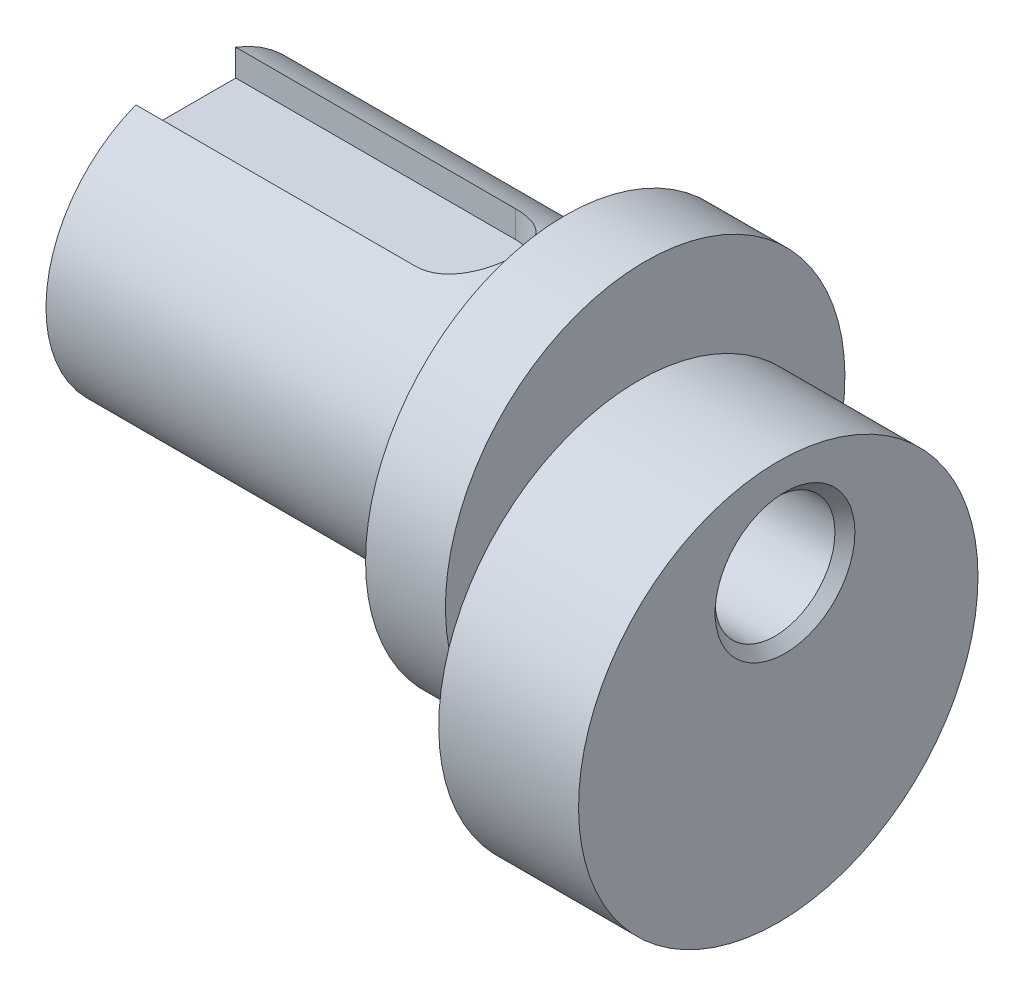
ISO-10303-21;
HEADER;
FILE_DESCRIPTION(('STEP AP214'),'2;1');
FILE_NAME('part.step','',(''),(''),'','','');
FILE_SCHEMA(('AUTOMOTIVE_DESIGN { 1 0 10303 214 1 1 1 1 }'));
ENDSEC;
DATA;
#1=APPLICATION_CONTEXT('core data for automotive mechanical design processes');
#2=APPLICATION_PROTOCOL_DEFINITION('international standard','automotive_design',2000,#1);
#3=PRODUCT_CONTEXT('',#1,'mechanical');
#4=PRODUCT('Part','Part','',(#3));
#5=PRODUCT_RELATED_PRODUCT_CATEGORY('part','',(#4));
#6=PRODUCT_DEFINITION_FORMATION('','',#4);
#7=PRODUCT_DEFINITION_CONTEXT('part definition',#1,'design');
#8=PRODUCT_DEFINITION('design','',#6,#7);
#9=PRODUCT_DEFINITION_SHAPE('','',#8);
#10=(LENGTH_UNIT() NAMED_UNIT(*) SI_UNIT(.MILLI.,.METRE.));
#11=(NAMED_UNIT(*) PLANE_ANGLE_UNIT() SI_UNIT($,.RADIAN.));
#12=(NAMED_UNIT(*) SI_UNIT($,.STERADIAN.) SOLID_ANGLE_UNIT());
#13=UNCERTAINTY_MEASURE_WITH_UNIT(LENGTH_MEASURE(1.E-05),#10,'distance_accuracy_value','');
#14=(GEOMETRIC_REPRESENTATION_CONTEXT(3) GLOBAL_UNCERTAINTY_ASSIGNED_CONTEXT((#13)) GLOBAL_UNIT_ASSIGNED_CONTEXT((#10,
#11,#12)) REPRESENTATION_CONTEXT('',''));
#15=CARTESIAN_POINT('',(0.,0.,0.));
#16=DIRECTION('',(0.,0.,1.));
#17=DIRECTION('',(1.,0.,0.));
#18=AXIS2_PLACEMENT_3D('',#15,#16,#17);
#19=CARTESIAN_POINT('',(-23.,5.,-0.336496213383556));
#20=DIRECTION('',(1.,0.,0.));
#21=DIRECTION('',(0.,0.,-1.));
#22=AXIS2_PLACEMENT_3D('',#19,#20,#21);
#23=CYLINDRICAL_SURFACE('',#22,7.);
#24=CARTESIAN_POINT('',(-4.,5.,-0.336496213383556));
#25=DIRECTION('',(-1.,0.,0.));
#26=DIRECTION('',(0.,0.,1.));
#27=AXIS2_PLACEMENT_3D('',#24,#25,#26);
#28=CIRCLE('',#27,7.);
#29=CARTESIAN_POINT('',(-4.,5.,6.66350378661644));
#30=VERTEX_POINT('',#29);
#31=EDGE_CURVE('E138',#30,#30,#28,.T.);
#32=ORIENTED_EDGE('',*,*,#31,.T.);
#33=EDGE_LOOP('',(#32));
#34=FACE_BOUND('',#33,.T.);
#35=DIRECTION('',(1.,0.,0.));
#36=VECTOR('',#35,1.);
#37=CARTESIAN_POINT('',(-23.,11.538348415311,-2.83649621338356));
#38=LINE('',#37,#36);
#39=CARTESIAN_POINT('',(-9.,11.538348415311,-2.83649621338356));
#40=VERTEX_POINT('',#39);
#41=CARTESIAN_POINT('',(-23.,11.538348415311,-2.83649621338356));
#42=VERTEX_POINT('',#41);
#43=EDGE_CURVE('E130',#40,#42,#38,.F.);
#44=ORIENTED_EDGE('',*,*,#43,.F.);
#45=CARTESIAN_POINT('',(-9.,11.538348415311,2.16350378661644));
#46=CARTESIAN_POINT('',(-8.93211075427106,11.5383365378513,2.16351310882548));
#47=CARTESIAN_POINT('',(-8.86422806736091,11.5394054992274,2.16073863738338));
#48=CARTESIAN_POINT('',(-8.72899608938858,11.5436165747813,2.14969480779804));
#49=CARTESIAN_POINT('',(-8.66164664139387,11.5467580541806,2.14142713212853));
#50=CARTESIAN_POINT('',(-8.52817858539721,11.5550121763794,2.11950553947544));
#51=CARTESIAN_POINT('',(-8.46205666366019,11.5601183170568,2.10586938625599));
#52=CARTESIAN_POINT('',(-8.33129816489152,11.5721317785417,2.07335494128293));
#53=CARTESIAN_POINT('',(-8.26666165368758,11.5790391790075,2.0544764176908));
#54=CARTESIAN_POINT('',(-8.07573563352248,11.6021493436571,1.99024342840849));
#55=CARTESIAN_POINT('',(-7.95220954786442,11.6207547534084,1.9372549126863));
#56=CARTESIAN_POINT('',(-7.71576966687202,11.6622539736071,1.81261136527069));
#57=CARTESIAN_POINT('',(-7.60286368326447,11.6851509042488,1.74094273710493));
#58=CARTESIAN_POINT('',(-7.38578478664729,11.7337991379222,1.57752949763614));
#59=CARTESIAN_POINT('',(-7.28215352480412,11.7596286404137,1.48508715808388));
#60=CARTESIAN_POINT('',(-7.09149129528357,11.8105759232303,1.28423767437974));
#61=CARTESIAN_POINT('',(-7.00446342075665,11.8356935701987,1.17582756214318));
#62=CARTESIAN_POINT('',(-6.84691014454501,11.8833113327905,0.942042939975786));
#63=CARTESIAN_POINT('',(-6.77696847813946,11.905708352238,0.816252124508294));
#64=CARTESIAN_POINT('',(-6.65946335320259,11.9444235767263,0.553754612093079));
#65=CARTESIAN_POINT('',(-6.61189222095399,11.9607438658547,0.41705167715677));
#66=CARTESIAN_POINT('',(-6.54235939781764,11.9849105051071,0.142333765872618));
#67=CARTESIAN_POINT('',(-6.51946086952892,11.9930659435251,0.00458362184390952));
#68=CARTESIAN_POINT('',(-6.49693159722235,12.0010879805382,-0.273031908086653));
#69=CARTESIAN_POINT('',(-6.49729441396535,12.000956873027,-0.412896697891005));
#70=CARTESIAN_POINT('',(-6.52071127376112,11.9926225804908,-0.684089471870503));
#71=CARTESIAN_POINT('',(-6.54274479419853,11.9847824358352,-0.815518620462278));
#72=CARTESIAN_POINT('',(-6.6071734241588,11.9623783250735,-1.07267202552716));
#73=CARTESIAN_POINT('',(-6.64956968436252,11.9478139789904,-1.19839595916402));
#74=CARTESIAN_POINT('',(-6.75404691156532,11.9131650689037,-1.44265723768163));
#75=CARTESIAN_POINT('',(-6.81639571496012,11.8930059216431,-1.56106900405262));
#76=CARTESIAN_POINT('',(-6.95877933522336,11.8492335561632,-1.78603152643879));
#77=CARTESIAN_POINT('',(-7.03881952378359,11.8256192895926,-1.89257866515126));
#78=CARTESIAN_POINT('',(-7.2193232636567,11.7759054780549,-2.09682066594426));
#79=CARTESIAN_POINT('',(-7.3206497231449,11.7497405584388,-2.19373807038773));
#80=CARTESIAN_POINT('',(-7.53832736416557,11.6989034246898,-2.36949535959652));
#81=CARTESIAN_POINT('',(-7.65468390516847,11.6742317476526,-2.44832876794818));
#82=CARTESIAN_POINT('',(-7.90194259852198,11.628778038754,-2.58699482236814));
#83=CARTESIAN_POINT('',(-8.03307897550541,11.6080787511899,-2.64643829327981));
#84=CARTESIAN_POINT('',(-8.30436480158219,11.5738821361027,-2.74205061064205));
#85=CARTESIAN_POINT('',(-8.44449914116898,11.5603730716505,-2.7782574073831));
#86=CARTESIAN_POINT('',(-8.65503054426421,11.5470854224556,-2.81355118486983));
#87=CARTESIAN_POINT('',(-8.72373630177179,11.5438201096791,-2.82214968924801));
#88=CARTESIAN_POINT('',(-8.86161516419169,11.5394491082968,-2.83361973513238));
#89=CARTESIAN_POINT('',(-8.93078766710051,11.5383410314094,-2.83649761003723));
#90=CARTESIAN_POINT('',(-9.,11.538348415311,-2.83649621338356));
#91=B_SPLINE_CURVE_WITH_KNOTS('',3,(#45,#46,#47,#48,#49,#50,#51,#52,#53,#54,#55,#56,#57,#58,#59,
#60,#61,#62,#63,#64,#65,#66,#67,#68,#69,#70,#71,#72,#73,#74,#75,#76,#77,#78,#79,#80,#81,#82,#83,
#84,#85,#86,#87,#88,#89,#90),.UNSPECIFIED.,.F.,.F.,(4,2,2,2,2,2,2,2,2,2,2,2,2,2,2,2,2,2,2,2,2,2,
4),(0.,0.20359162855159,0.407120929225528,0.609982356545743,0.812852756635989,1.21793118555512,
1.6233052814847,2.0451597231193,2.4670926781184,2.90188398965561,3.33652604665238,
3.75400993940862,4.17137826416922,4.56998920861347,4.96862268086888,5.37284909448639,
5.77719841367921,6.20315837945088,6.62927065674721,7.06347329058505,7.49696496492444,
7.70468580162773,7.91217653896403),.UNSPECIFIED.);
#92=CARTESIAN_POINT('',(-9.,11.538348415311,2.16350378661644));
#93=VERTEX_POINT('',#92);
#94=EDGE_CURVE('E11',#93,#40,#91,.T.);
#95=ORIENTED_EDGE('',*,*,#94,.F.);
#96=DIRECTION('',(1.,0.,0.));
#97=VECTOR('',#96,1.);
#98=CARTESIAN_POINT('',(-23.,11.538348415311,2.16350378661645));
#99=LINE('',#98,#97);
#100=CARTESIAN_POINT('',(-23.,11.538348415311,2.16350378661645));
#101=VERTEX_POINT('',#100);
#102=EDGE_CURVE('E109',#101,#93,#99,.T.);
#103=ORIENTED_EDGE('',*,*,#102,.F.);
#104=CARTESIAN_POINT('',(-23.,5.,-0.336496213383556));
#105=DIRECTION('',(-1.,0.,0.));
#106=DIRECTION('',(0.,0.,1.));
#107=AXIS2_PLACEMENT_3D('',#104,#105,#106);
#108=CIRCLE('',#107,7.);
#109=EDGE_CURVE('E133',#42,#101,#108,.T.);
#110=ORIENTED_EDGE('',*,*,#109,.F.);
#111=EDGE_LOOP('',(#44,#95,#103,#110));
#112=FACE_BOUND('',#111,.T.);
#113=ADVANCED_FACE('F45',(#34,#112),#23,.T.);
#114=CARTESIAN_POINT('',(-23.,5.,-0.336496213383556));
#115=DIRECTION('',(-1.,0.,0.));
#116=DIRECTION('',(0.,0.,1.));
#117=AXIS2_PLACEMENT_3D('',#114,#115,#116);
#118=PLANE('',#117);
#119=CARTESIAN_POINT('',(-23.,5.,-0.336496213383556));
#120=DIRECTION('',(-1.,0.,0.));
#121=DIRECTION('',(0.,0.,1.));
#122=AXIS2_PLACEMENT_3D('',#119,#120,#121);
#123=CIRCLE('',#122,3.5);
#124=CARTESIAN_POINT('',(-23.,5.,3.16350378661644));
#125=VERTEX_POINT('',#124);
#126=EDGE_CURVE('E168',#125,#125,#123,.F.);
#127=ORIENTED_EDGE('',*,*,#126,.T.);
#128=EDGE_LOOP('',(#127));
#129=FACE_BOUND('',#128,.T.);
#130=DIRECTION('',(0.,0.,1.));
#131=VECTOR('',#130,1.);
#132=CARTESIAN_POINT('',(-23.,10.2,-0.336496213383556));
#133=LINE('',#132,#131);
#134=CARTESIAN_POINT('',(-23.,10.2,-2.83649621338356));
#135=VERTEX_POINT('',#134);
#136=CARTESIAN_POINT('',(-23.,10.2,2.16350378661645));
#137=VERTEX_POINT('',#136);
#138=EDGE_CURVE('E172',#135,#137,#133,.T.);
#139=ORIENTED_EDGE('',*,*,#138,.F.);
#140=DIRECTION('',(0.,1.,0.));
#141=VECTOR('',#140,1.);
#142=CARTESIAN_POINT('',(-23.,5.,-2.83649621338356));
#143=LINE('',#142,#141);
#144=EDGE_CURVE('E61',#135,#42,#143,.T.);
#145=ORIENTED_EDGE('',*,*,#144,.T.);
#146=ORIENTED_EDGE('',*,*,#109,.T.);
#147=DIRECTION('',(0.,-1.,0.));
#148=VECTOR('',#147,1.);
#149=CARTESIAN_POINT('',(-23.,5.,2.16350378661645));
#150=LINE('',#149,#148);
#151=EDGE_CURVE('E175',#101,#137,#150,.T.);
#152=ORIENTED_EDGE('',*,*,#151,.T.);
#153=EDGE_LOOP('',(#139,#145,#146,#152));
#154=FACE_BOUND('',#153,.T.);
#155=ADVANCED_FACE('F181',(#129,#154),#118,.T.);
#156=CARTESIAN_POINT('',(7.,0.,0.));
#157=DIRECTION('',(-1.,0.,0.));
#158=DIRECTION('',(0.,0.,1.));
#159=AXIS2_PLACEMENT_3D('',#156,#157,#158);
#160=CYLINDRICAL_SURFACE('',#159,9.99999999999999);
#161=CARTESIAN_POINT('',(7.,0.,0.));
#162=DIRECTION('',(1.,0.,0.));
#163=DIRECTION('',(0.,0.,-1.));
#164=AXIS2_PLACEMENT_3D('',#161,#162,#163);
#165=CIRCLE('',#164,9.99999999999999);
#166=CARTESIAN_POINT('',(7.,0.,-9.99999999999999));
#167=VERTEX_POINT('',#166);
#168=EDGE_CURVE('E143',#167,#167,#165,.T.);
#169=ORIENTED_EDGE('',*,*,#168,.F.);
#170=EDGE_LOOP('',(#169));
#171=FACE_BOUND('',#170,.T.);
#172=CARTESIAN_POINT('',(0.,0.,0.));
#173=DIRECTION('',(1.,0.,0.));
#174=DIRECTION('',(0.,0.,-1.));
#175=AXIS2_PLACEMENT_3D('',#172,#173,#174);
#176=CIRCLE('',#175,9.99999999999999);
#177=CARTESIAN_POINT('',(0.,1.84994671317873,-9.8273952377219));
#178=VERTEX_POINT('',#177);
#179=CARTESIAN_POINT('',(0.,3.15005328682125,9.49089902433835));
#180=VERTEX_POINT('',#179);
#181=EDGE_CURVE('E154',#178,#180,#176,.T.);
#182=ORIENTED_EDGE('',*,*,#181,.T.);
#183=EDGE_CURVE('E148',#180,#178,#176,.T.);
#184=ORIENTED_EDGE('',*,*,#183,.T.);
#185=EDGE_LOOP('',(#182,#184));
#186=FACE_BOUND('',#185,.T.);
#187=ADVANCED_FACE('F199',(#171,#186),#160,.T.);
#188=CARTESIAN_POINT('',(7.,0.,0.));
#189=DIRECTION('',(1.,0.,0.));
#190=DIRECTION('',(0.,0.,-1.));
#191=AXIS2_PLACEMENT_3D('',#188,#189,#190);
#192=PLANE('',#191);
#193=CARTESIAN_POINT('',(7.,5.,-0.336496213383556));
#194=DIRECTION('',(1.,0.,0.));
#195=DIRECTION('',(0.,0.,-1.));
#196=AXIS2_PLACEMENT_3D('',#193,#194,#195);
#197=CIRCLE('',#196,3.5);
#198=CARTESIAN_POINT('',(7.,5.,-3.83649621338356));
#199=VERTEX_POINT('',#198);
#200=EDGE_CURVE('E142',#199,#199,#197,.F.);
#201=ORIENTED_EDGE('',*,*,#200,.T.);
#202=EDGE_LOOP('',(#201));
#203=FACE_BOUND('',#202,.T.);
#204=ORIENTED_EDGE('',*,*,#168,.T.);
#205=EDGE_LOOP('',(#204));
#206=FACE_BOUND('',#205,.T.);
#207=ADVANCED_FACE('F219',(#203,#206),#192,.T.);
#208=CARTESIAN_POINT('',(0.,0.,0.));
#209=DIRECTION('',(1.,0.,0.));
#210=DIRECTION('',(0.,0.,-1.));
#211=AXIS2_PLACEMENT_3D('',#208,#209,#210);
#212=PLANE('',#211);
#213=CARTESIAN_POINT('',(0.,5.,-0.336496213383556));
#214=DIRECTION('',(-1.,0.,0.));
#215=DIRECTION('',(0.,0.,1.));
#216=AXIS2_PLACEMENT_3D('',#213,#214,#215);
#217=CIRCLE('',#216,10.);
#218=EDGE_CURVE('E75',#178,#180,#217,.T.);
#219=ORIENTED_EDGE('',*,*,#218,.F.);
#220=ORIENTED_EDGE('',*,*,#183,.F.);
#221=EDGE_LOOP('',(#219,#220));
#222=FACE_BOUND('',#221,.T.);
#223=ADVANCED_FACE('F217',(#222),#212,.F.);
#224=CARTESIAN_POINT('',(-4.,5.,-0.336496213383556));
#225=DIRECTION('',(1.,0.,0.));
#226=DIRECTION('',(0.,0.,-1.));
#227=AXIS2_PLACEMENT_3D('',#224,#225,#226);
#228=CYLINDRICAL_SURFACE('',#227,10.);
#229=CARTESIAN_POINT('',(-4.,5.,-0.336496213383556));
#230=DIRECTION('',(-1.,0.,0.));
#231=DIRECTION('',(0.,0.,1.));
#232=AXIS2_PLACEMENT_3D('',#229,#230,#231);
#233=CIRCLE('',#232,10.);
#234=CARTESIAN_POINT('',(-4.,5.,9.66350378661644));
#235=VERTEX_POINT('',#234);
#236=EDGE_CURVE('E144',#235,#235,#233,.T.);
#237=ORIENTED_EDGE('',*,*,#236,.F.);
#238=EDGE_LOOP('',(#237));
#239=FACE_BOUND('',#238,.T.);
#240=ORIENTED_EDGE('',*,*,#218,.T.);
#241=EDGE_CURVE('E137',#180,#178,#217,.T.);
#242=ORIENTED_EDGE('',*,*,#241,.T.);
#243=EDGE_LOOP('',(#240,#242));
#244=FACE_BOUND('',#243,.T.);
#245=ADVANCED_FACE('F209',(#239,#244),#228,.T.);
#246=CARTESIAN_POINT('',(-4.,5.,-0.336496213383556));
#247=DIRECTION('',(-1.,0.,0.));
#248=DIRECTION('',(0.,0.,1.));
#249=AXIS2_PLACEMENT_3D('',#246,#247,#248);
#250=PLANE('',#249);
#251=ORIENTED_EDGE('',*,*,#31,.F.);
#252=EDGE_LOOP('',(#251));
#253=FACE_BOUND('',#252,.T.);
#254=ORIENTED_EDGE('',*,*,#236,.T.);
#255=EDGE_LOOP('',(#254));
#256=FACE_BOUND('',#255,.T.);
#257=ADVANCED_FACE('F205',(#253,#256),#250,.T.);
#258=CARTESIAN_POINT('',(0.,5.,-0.336496213383556));
#259=DIRECTION('',(-1.,0.,0.));
#260=DIRECTION('',(0.,0.,1.));
#261=AXIS2_PLACEMENT_3D('',#258,#259,#260);
#262=PLANE('',#261);
#263=ORIENTED_EDGE('',*,*,#181,.F.);
#264=ORIENTED_EDGE('',*,*,#241,.F.);
#265=EDGE_LOOP('',(#263,#264));
#266=FACE_BOUND('',#265,.T.);
#267=ADVANCED_FACE('F208',(#266),#262,.F.);
#268=CARTESIAN_POINT('',(7.,5.,-0.336496213383556));
#269=DIRECTION('',(-1.,0.,0.));
#270=DIRECTION('',(0.,0.,1.));
#271=AXIS2_PLACEMENT_3D('',#268,#269,#270);
#272=CYLINDRICAL_SURFACE('',#271,3.);
#273=CARTESIAN_POINT('',(6.5,5.,-0.336496213383556));
#274=DIRECTION('',(1.,0.,0.));
#275=DIRECTION('',(0.,0.,-1.));
#276=AXIS2_PLACEMENT_3D('',#273,#274,#275);
#277=CIRCLE('',#276,3.);
#278=CARTESIAN_POINT('',(6.5,5.,-3.33649621338356));
#279=VERTEX_POINT('',#278);
#280=EDGE_CURVE('E164',#279,#279,#277,.T.);
#281=ORIENTED_EDGE('',*,*,#280,.T.);
#282=EDGE_LOOP('',(#281));
#283=FACE_BOUND('',#282,.T.);
#284=CARTESIAN_POINT('',(-22.5,5.,-0.336496213383556));
#285=DIRECTION('',(-1.,0.,0.));
#286=DIRECTION('',(0.,0.,1.));
#287=AXIS2_PLACEMENT_3D('',#284,#285,#286);
#288=CIRCLE('',#287,3.);
#289=CARTESIAN_POINT('',(-22.5,5.,2.66350378661644));
#290=VERTEX_POINT('',#289);
#291=EDGE_CURVE('E160',#290,#290,#288,.T.);
#292=ORIENTED_EDGE('',*,*,#291,.T.);
#293=EDGE_LOOP('',(#292));
#294=FACE_BOUND('',#293,.T.);
#295=ADVANCED_FACE('F213',(#283,#294),#272,.F.);
#296=CARTESIAN_POINT('',(7.,5.,-0.336496213383556));
#297=DIRECTION('',(1.,0.,0.));
#298=DIRECTION('',(0.,0.,-1.));
#299=AXIS2_PLACEMENT_3D('',#296,#297,#298);
#300=CONICAL_SURFACE('',#299,3.5,0.785398163397445);
#301=ORIENTED_EDGE('',*,*,#280,.F.);
#302=EDGE_LOOP('',(#301));
#303=FACE_BOUND('',#302,.T.);
#304=ORIENTED_EDGE('',*,*,#200,.F.);
#305=EDGE_LOOP('',(#304));
#306=FACE_BOUND('',#305,.T.);
#307=ADVANCED_FACE('F228',(#303,#306),#300,.F.);
#308=CARTESIAN_POINT('',(-22.5,5.,-0.336496213383556));
#309=DIRECTION('',(-1.,0.,0.));
#310=DIRECTION('',(0.,0.,1.));
#311=AXIS2_PLACEMENT_3D('',#308,#309,#310);
#312=CONICAL_SURFACE('',#311,3.,0.785398163397454);
#313=ORIENTED_EDGE('',*,*,#126,.F.);
#314=EDGE_LOOP('',(#313));
#315=FACE_BOUND('',#314,.T.);
#316=ORIENTED_EDGE('',*,*,#291,.F.);
#317=EDGE_LOOP('',(#316));
#318=FACE_BOUND('',#317,.T.);
#319=ADVANCED_FACE('F48',(#315,#318),#312,.F.);
#320=CARTESIAN_POINT('',(-9.,15.,-0.336496213383556));
#321=DIRECTION('',(0.,-1.,0.));
#322=DIRECTION('',(0.,0.,-1.));
#323=AXIS2_PLACEMENT_3D('',#320,#321,#322);
#324=CYLINDRICAL_SURFACE('',#323,2.5);
#325=ORIENTED_EDGE('',*,*,#94,.T.);
#326=DIRECTION('',(0.,-1.,0.));
#327=VECTOR('',#326,1.);
#328=CARTESIAN_POINT('',(-9.,15.,-2.83649621338356));
#329=LINE('',#328,#327);
#330=CARTESIAN_POINT('',(-9.,10.2,-2.83649621338356));
#331=VERTEX_POINT('',#330);
#332=EDGE_CURVE('E101',#40,#331,#329,.T.);
#333=ORIENTED_EDGE('',*,*,#332,.T.);
#334=CARTESIAN_POINT('',(-9.,10.2,-0.336496213383556));
#335=DIRECTION('',(0.,1.,0.));
#336=DIRECTION('',(0.,0.,-1.));
#337=AXIS2_PLACEMENT_3D('',#334,#335,#336);
#338=CIRCLE('',#337,2.5);
#339=CARTESIAN_POINT('',(-9.,10.2,2.16350378661644));
#340=VERTEX_POINT('',#339);
#341=EDGE_CURVE('E104',#340,#331,#338,.T.);
#342=ORIENTED_EDGE('',*,*,#341,.F.);
#343=DIRECTION('',(0.,-1.,0.));
#344=VECTOR('',#343,1.);
#345=CARTESIAN_POINT('',(-9.,15.,2.16350378661644));
#346=LINE('',#345,#344);
#347=EDGE_CURVE('E110',#93,#340,#346,.T.);
#348=ORIENTED_EDGE('',*,*,#347,.F.);
#349=EDGE_LOOP('',(#325,#333,#342,#348));
#350=FACE_BOUND('',#349,.T.);
#351=ADVANCED_FACE('F102',(#350),#324,.F.);
#352=CARTESIAN_POINT('',(-9.,15.,-2.83649621338356));
#353=DIRECTION('',(0.,0.,1.));
#354=DIRECTION('',(1.,0.,0.));
#355=AXIS2_PLACEMENT_3D('',#352,#353,#354);
#356=PLANE('',#355);
#357=ORIENTED_EDGE('',*,*,#43,.T.);
#358=ORIENTED_EDGE('',*,*,#144,.F.);
#359=DIRECTION('',(-1.,0.,0.));
#360=VECTOR('',#359,1.);
#361=CARTESIAN_POINT('',(-9.,10.2,-2.83649621338356));
#362=LINE('',#361,#360);
#363=EDGE_CURVE('E68',#331,#135,#362,.T.);
#364=ORIENTED_EDGE('',*,*,#363,.F.);
#365=ORIENTED_EDGE('',*,*,#332,.F.);
#366=EDGE_LOOP('',(#357,#358,#364,#365));
#367=FACE_BOUND('',#366,.T.);
#368=ADVANCED_FACE('F112',(#367),#356,.T.);
#369=CARTESIAN_POINT('',(-9.,15.,2.16350378661644));
#370=DIRECTION('',(0.,0.,-1.));
#371=DIRECTION('',(-1.,0.,0.));
#372=AXIS2_PLACEMENT_3D('',#369,#370,#371);
#373=PLANE('',#372);
#374=ORIENTED_EDGE('',*,*,#102,.T.);
#375=ORIENTED_EDGE('',*,*,#347,.T.);
#376=DIRECTION('',(1.,0.,0.));
#377=VECTOR('',#376,1.);
#378=CARTESIAN_POINT('',(-9.,10.2,2.16350378661644));
#379=LINE('',#378,#377);
#380=EDGE_CURVE('E116',#137,#340,#379,.T.);
#381=ORIENTED_EDGE('',*,*,#380,.F.);
#382=ORIENTED_EDGE('',*,*,#151,.F.);
#383=EDGE_LOOP('',(#374,#375,#381,#382));
#384=FACE_BOUND('',#383,.T.);
#385=ADVANCED_FACE('F185',(#384),#373,.T.);
#386=CARTESIAN_POINT('',(-9.,10.2,-0.336496213383556));
#387=DIRECTION('',(0.,-1.,0.));
#388=DIRECTION('',(0.,0.,-1.));
#389=AXIS2_PLACEMENT_3D('',#386,#387,#388);
#390=PLANE('',#389);
#391=ORIENTED_EDGE('',*,*,#138,.T.);
#392=ORIENTED_EDGE('',*,*,#380,.T.);
#393=ORIENTED_EDGE('',*,*,#341,.T.);
#394=ORIENTED_EDGE('',*,*,#363,.T.);
#395=EDGE_LOOP('',(#391,#392,#393,#394));
#396=FACE_BOUND('',#395,.T.);
#397=ADVANCED_FACE('F119',(#396),#390,.F.);
#398=CLOSED_SHELL('',(#113,#155,#187,#207,#223,#245,#257,#267,#295,#307,#319,#351,#368,#385,#397));
#399=MANIFOLD_SOLID_BREP('B2',#398);
#400=ADVANCED_BREP_SHAPE_REPRESENTATION('',(#18,#399),#14);
#401=SHAPE_DEFINITION_REPRESENTATION(#9,#400);
ENDSEC;
END-ISO-10303-21;
